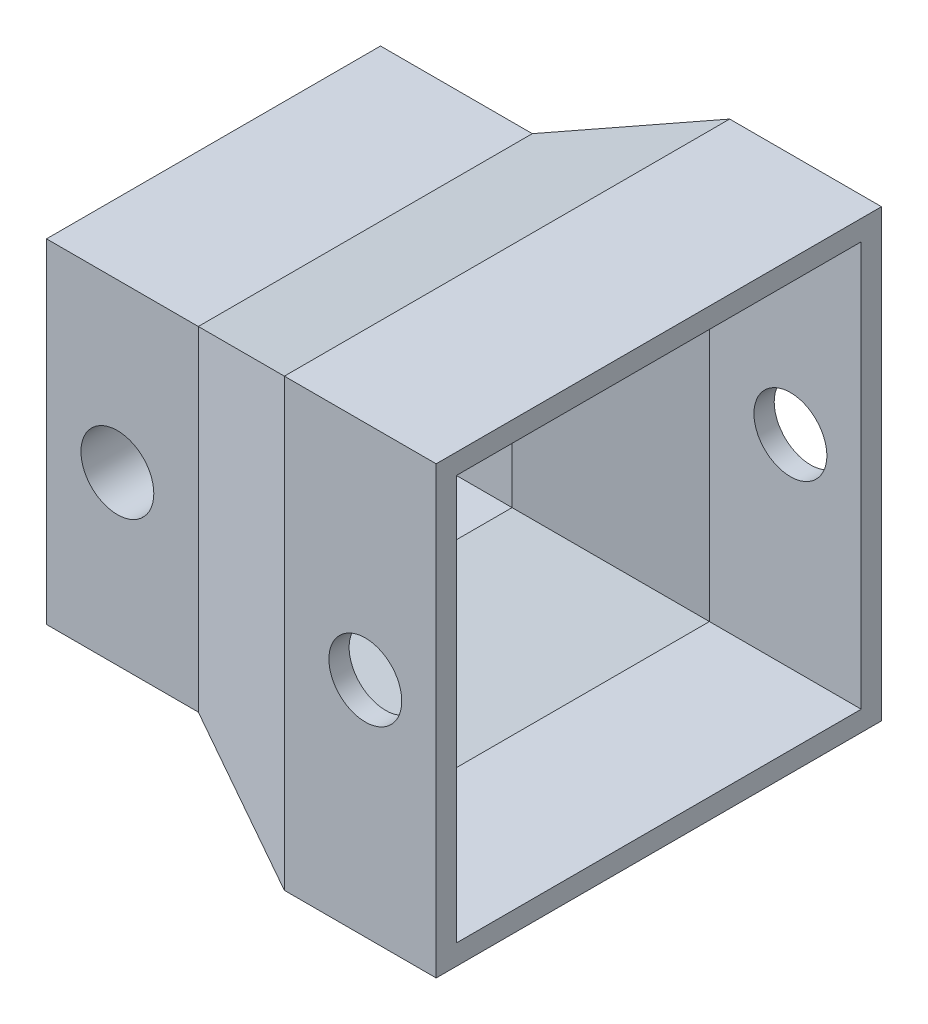
ISO-10303-21;
HEADER;
FILE_DESCRIPTION(('STEP AP214'),'2;1');
FILE_NAME('part.step','',(''),(''),'','','');
FILE_SCHEMA(('AUTOMOTIVE_DESIGN { 1 0 10303 214 1 1 1 1 }'));
ENDSEC;
DATA;
#1=APPLICATION_CONTEXT('core data for automotive mechanical design processes');
#2=APPLICATION_PROTOCOL_DEFINITION('international standard','automotive_design',2000,#1);
#3=PRODUCT_CONTEXT('',#1,'mechanical');
#4=PRODUCT('Part','Part','',(#3));
#5=PRODUCT_RELATED_PRODUCT_CATEGORY('part','',(#4));
#6=PRODUCT_DEFINITION_FORMATION('','',#4);
#7=PRODUCT_DEFINITION_CONTEXT('part definition',#1,'design');
#8=PRODUCT_DEFINITION('design','',#6,#7);
#9=PRODUCT_DEFINITION_SHAPE('','',#8);
#10=(LENGTH_UNIT() NAMED_UNIT(*) SI_UNIT(.MILLI.,.METRE.));
#11=(NAMED_UNIT(*) PLANE_ANGLE_UNIT() SI_UNIT($,.RADIAN.));
#12=(NAMED_UNIT(*) SI_UNIT($,.STERADIAN.) SOLID_ANGLE_UNIT());
#13=UNCERTAINTY_MEASURE_WITH_UNIT(LENGTH_MEASURE(1.E-05),#10,'distance_accuracy_value','');
#14=(GEOMETRIC_REPRESENTATION_CONTEXT(3) GLOBAL_UNCERTAINTY_ASSIGNED_CONTEXT((#13)) GLOBAL_UNIT_ASSIGNED_CONTEXT((#10,
#11,#12)) REPRESENTATION_CONTEXT('',''));
#15=CARTESIAN_POINT('',(0.,0.,0.));
#16=DIRECTION('',(0.,0.,1.));
#17=DIRECTION('',(1.,0.,0.));
#18=AXIS2_PLACEMENT_3D('',#15,#16,#17);
#19=CARTESIAN_POINT('',(11.,-11.,18.25));
#20=DIRECTION('',(0.,0.,1.));
#21=DIRECTION('',(1.,0.,0.));
#22=AXIS2_PLACEMENT_3D('',#19,#20,#21);
#23=PLANE('',#22);
#24=CARTESIAN_POINT('',(15.,0.,18.25));
#25=DIRECTION('',(0.,0.,1.));
#26=DIRECTION('',(1.,0.,0.));
#27=AXIS2_PLACEMENT_3D('',#24,#25,#26);
#28=CIRCLE('',#27,1.8);
#29=CARTESIAN_POINT('',(16.8,0.,18.25));
#30=VERTEX_POINT('',#29);
#31=EDGE_CURVE('E643',#30,#30,#28,.T.);
#32=ORIENTED_EDGE('',*,*,#31,.F.);
#33=EDGE_LOOP('',(#32));
#34=FACE_BOUND('',#33,.T.);
#35=DIRECTION('',(1.,0.,0.));
#36=VECTOR('',#35,1.);
#37=CARTESIAN_POINT('',(11.,-11.,18.25));
#38=LINE('',#37,#36);
#39=CARTESIAN_POINT('',(11.,-11.,18.25));
#40=VERTEX_POINT('',#39);
#41=CARTESIAN_POINT('',(18.5,-11.,18.25));
#42=VERTEX_POINT('',#41);
#43=EDGE_CURVE('E161',#40,#42,#38,.T.);
#44=ORIENTED_EDGE('',*,*,#43,.T.);
#45=DIRECTION('',(0.,-1.,0.));
#46=VECTOR('',#45,1.);
#47=CARTESIAN_POINT('',(18.5,-11.,18.25));
#48=LINE('',#47,#46);
#49=CARTESIAN_POINT('',(18.5,11.,18.25));
#50=VERTEX_POINT('',#49);
#51=EDGE_CURVE('E780',#50,#42,#48,.T.);
#52=ORIENTED_EDGE('',*,*,#51,.F.);
#53=DIRECTION('',(1.,0.,0.));
#54=VECTOR('',#53,1.);
#55=CARTESIAN_POINT('',(11.,11.,18.25));
#56=LINE('',#55,#54);
#57=CARTESIAN_POINT('',(11.,11.,18.25));
#58=VERTEX_POINT('',#57);
#59=EDGE_CURVE('E12',#58,#50,#56,.T.);
#60=ORIENTED_EDGE('',*,*,#59,.F.);
#61=CARTESIAN_POINT('',(11.,11.,18.25));
#62=DIRECTION('',(0.,-1.,0.));
#63=VECTOR('',#62,1.);
#64=LINE('',#61,#63);
#65=EDGE_CURVE('E177',#58,#40,#64,.T.);
#66=ORIENTED_EDGE('',*,*,#65,.T.);
#67=EDGE_LOOP('',(#44,#52,#60,#66));
#68=FACE_BOUND('',#67,.T.);
#69=ADVANCED_FACE('F76',(#34,#68),#23,.T.);
#70=CARTESIAN_POINT('',(11.,11.,18.25));
#71=DIRECTION('',(0.,1.,0.));
#72=DIRECTION('',(0.,0.,1.));
#73=AXIS2_PLACEMENT_3D('',#70,#71,#72);
#74=PLANE('',#73);
#75=ORIENTED_EDGE('',*,*,#59,.T.);
#76=DIRECTION('',(0.,0.,1.));
#77=VECTOR('',#76,1.);
#78=CARTESIAN_POINT('',(18.5,11.,18.25));
#79=LINE('',#78,#77);
#80=CARTESIAN_POINT('',(18.5,11.,-3.75));
#81=VERTEX_POINT('',#80);
#82=EDGE_CURVE('E771',#81,#50,#79,.T.);
#83=ORIENTED_EDGE('',*,*,#82,.F.);
#84=DIRECTION('',(1.,0.,0.));
#85=VECTOR('',#84,1.);
#86=CARTESIAN_POINT('',(11.,11.,-3.75));
#87=LINE('',#86,#85);
#88=CARTESIAN_POINT('',(11.,11.,-3.75));
#89=VERTEX_POINT('',#88);
#90=EDGE_CURVE('E87',#89,#81,#87,.T.);
#91=ORIENTED_EDGE('',*,*,#90,.F.);
#92=DIRECTION('',(0.,0.,1.));
#93=VECTOR('',#92,1.);
#94=CARTESIAN_POINT('',(11.,11.,18.25));
#95=LINE('',#94,#93);
#96=EDGE_CURVE('E96',#89,#58,#95,.T.);
#97=ORIENTED_EDGE('',*,*,#96,.T.);
#98=EDGE_LOOP('',(#75,#83,#91,#97));
#99=FACE_BOUND('',#98,.T.);
#100=ADVANCED_FACE('F541',(#99),#74,.T.);
#101=CARTESIAN_POINT('',(11.,-11.,-3.75));
#102=DIRECTION('',(0.,0.,-1.));
#103=DIRECTION('',(-1.,0.,0.));
#104=AXIS2_PLACEMENT_3D('',#101,#102,#103);
#105=PLANE('',#104);
#106=CARTESIAN_POINT('',(15.,0.,-3.75));
#107=DIRECTION('',(0.,0.,-1.));
#108=DIRECTION('',(-1.,0.,0.));
#109=AXIS2_PLACEMENT_3D('',#106,#107,#108);
#110=CIRCLE('',#109,1.8);
#111=CARTESIAN_POINT('',(13.2,0.,-3.75));
#112=VERTEX_POINT('',#111);
#113=EDGE_CURVE('E654',#112,#112,#110,.T.);
#114=ORIENTED_EDGE('',*,*,#113,.F.);
#115=EDGE_LOOP('',(#114));
#116=FACE_BOUND('',#115,.T.);
#117=ORIENTED_EDGE('',*,*,#90,.T.);
#118=DIRECTION('',(0.,1.,0.));
#119=VECTOR('',#118,1.);
#120=CARTESIAN_POINT('',(18.5,-11.,-3.75));
#121=LINE('',#120,#119);
#122=CARTESIAN_POINT('',(18.5,-11.,-3.75));
#123=VERTEX_POINT('',#122);
#124=EDGE_CURVE('E774',#123,#81,#121,.T.);
#125=ORIENTED_EDGE('',*,*,#124,.F.);
#126=DIRECTION('',(1.,0.,0.));
#127=VECTOR('',#126,1.);
#128=CARTESIAN_POINT('',(11.,-11.,-3.75));
#129=LINE('',#128,#127);
#130=CARTESIAN_POINT('',(11.,-11.,-3.75));
#131=VERTEX_POINT('',#130);
#132=EDGE_CURVE('E174',#131,#123,#129,.T.);
#133=ORIENTED_EDGE('',*,*,#132,.F.);
#134=CARTESIAN_POINT('',(11.,-11.,-3.75));
#135=DIRECTION('',(0.,1.,0.));
#136=VECTOR('',#135,1.);
#137=LINE('',#134,#136);
#138=EDGE_CURVE('E207',#131,#89,#137,.T.);
#139=ORIENTED_EDGE('',*,*,#138,.T.);
#140=EDGE_LOOP('',(#117,#125,#133,#139));
#141=FACE_BOUND('',#140,.T.);
#142=ADVANCED_FACE('F532',(#116,#141),#105,.T.);
#143=CARTESIAN_POINT('',(11.,-11.,18.25));
#144=DIRECTION('',(0.,-1.,0.));
#145=DIRECTION('',(0.,0.,-1.));
#146=AXIS2_PLACEMENT_3D('',#143,#144,#145);
#147=PLANE('',#146);
#148=ORIENTED_EDGE('',*,*,#132,.T.);
#149=DIRECTION('',(0.,0.,-1.));
#150=VECTOR('',#149,1.);
#151=CARTESIAN_POINT('',(18.5,-11.,18.25));
#152=LINE('',#151,#150);
#153=EDGE_CURVE('E169',#42,#123,#152,.T.);
#154=ORIENTED_EDGE('',*,*,#153,.F.);
#155=ORIENTED_EDGE('',*,*,#43,.F.);
#156=CARTESIAN_POINT('',(11.,-11.,18.25));
#157=DIRECTION('',(0.,0.,-1.));
#158=VECTOR('',#157,1.);
#159=LINE('',#156,#158);
#160=EDGE_CURVE('E165',#40,#131,#159,.T.);
#161=ORIENTED_EDGE('',*,*,#160,.T.);
#162=EDGE_LOOP('',(#148,#154,#155,#161));
#163=FACE_BOUND('',#162,.T.);
#164=ADVANCED_FACE('F163',(#163),#147,.T.);
#165=CARTESIAN_POINT('',(11.,-10.,17.25));
#166=DIRECTION('',(0.,0.,1.));
#167=DIRECTION('',(1.,0.,0.));
#168=AXIS2_PLACEMENT_3D('',#165,#166,#167);
#169=PLANE('',#168);
#170=CARTESIAN_POINT('',(15.,0.,17.25));
#171=DIRECTION('',(0.,0.,1.));
#172=DIRECTION('',(1.,0.,0.));
#173=AXIS2_PLACEMENT_3D('',#170,#171,#172);
#174=CIRCLE('',#173,1.8);
#175=CARTESIAN_POINT('',(16.8,0.,17.25));
#176=VERTEX_POINT('',#175);
#177=EDGE_CURVE('E649',#176,#176,#174,.T.);
#178=ORIENTED_EDGE('',*,*,#177,.T.);
#179=EDGE_LOOP('',(#178));
#180=FACE_BOUND('',#179,.T.);
#181=DIRECTION('',(1.,0.,0.));
#182=VECTOR('',#181,1.);
#183=CARTESIAN_POINT('',(11.,10.,17.25));
#184=LINE('',#183,#182);
#185=CARTESIAN_POINT('',(11.,10.,17.25));
#186=VERTEX_POINT('',#185);
#187=CARTESIAN_POINT('',(18.5,10.,17.25));
#188=VERTEX_POINT('',#187);
#189=EDGE_CURVE('E183',#186,#188,#184,.T.);
#190=ORIENTED_EDGE('',*,*,#189,.T.);
#191=DIRECTION('',(0.,-1.,0.));
#192=VECTOR('',#191,1.);
#193=CARTESIAN_POINT('',(18.5,-10.,17.25));
#194=LINE('',#193,#192);
#195=CARTESIAN_POINT('',(18.5,-10.,17.25));
#196=VERTEX_POINT('',#195);
#197=EDGE_CURVE('E795',#188,#196,#194,.T.);
#198=ORIENTED_EDGE('',*,*,#197,.T.);
#199=DIRECTION('',(1.,0.,0.));
#200=VECTOR('',#199,1.);
#201=CARTESIAN_POINT('',(11.,-10.,17.25));
#202=LINE('',#201,#200);
#203=CARTESIAN_POINT('',(11.,-10.,17.25));
#204=VERTEX_POINT('',#203);
#205=EDGE_CURVE('E595',#204,#196,#202,.T.);
#206=ORIENTED_EDGE('',*,*,#205,.F.);
#207=CARTESIAN_POINT('',(11.,9.99999999999996,17.25));
#208=DIRECTION('',(0.,-1.,0.));
#209=VECTOR('',#208,1.);
#210=LINE('',#207,#209);
#211=EDGE_CURVE('E769',#186,#204,#210,.T.);
#212=ORIENTED_EDGE('',*,*,#211,.F.);
#213=EDGE_LOOP('',(#190,#198,#206,#212));
#214=FACE_BOUND('',#213,.T.);
#215=ADVANCED_FACE('F546',(#180,#214),#169,.F.);
#216=CARTESIAN_POINT('',(11.,10.,-2.75));
#217=DIRECTION('',(0.,1.,0.));
#218=DIRECTION('',(0.,0.,1.));
#219=AXIS2_PLACEMENT_3D('',#216,#217,#218);
#220=PLANE('',#219);
#221=DIRECTION('',(1.,0.,0.));
#222=VECTOR('',#221,1.);
#223=CARTESIAN_POINT('',(11.,10.,-2.75));
#224=LINE('',#223,#222);
#225=CARTESIAN_POINT('',(11.,10.0000062500001,-2.75000624999989));
#226=VERTEX_POINT('',#225);
#227=CARTESIAN_POINT('',(18.5,10.,-2.75));
#228=VERTEX_POINT('',#227);
#229=EDGE_CURVE('E601',#226,#228,#224,.T.);
#230=ORIENTED_EDGE('',*,*,#229,.T.);
#231=DIRECTION('',(0.,0.,1.));
#232=VECTOR('',#231,1.);
#233=CARTESIAN_POINT('',(18.5,10.,-2.75));
#234=LINE('',#233,#232);
#235=EDGE_CURVE('E783',#228,#188,#234,.T.);
#236=ORIENTED_EDGE('',*,*,#235,.T.);
#237=ORIENTED_EDGE('',*,*,#189,.F.);
#238=DIRECTION('',(0.,0.,1.));
#239=VECTOR('',#238,1.);
#240=CARTESIAN_POINT('',(11.,10.,0.));
#241=LINE('',#240,#239);
#242=EDGE_CURVE('E117',#226,#186,#241,.T.);
#243=ORIENTED_EDGE('',*,*,#242,.F.);
#244=EDGE_LOOP('',(#230,#236,#237,#243));
#245=FACE_BOUND('',#244,.T.);
#246=ADVANCED_FACE('F580',(#245),#220,.F.);
#247=CARTESIAN_POINT('',(11.,-10.,-2.75));
#248=DIRECTION('',(0.,0.,-1.));
#249=DIRECTION('',(-1.,0.,0.));
#250=AXIS2_PLACEMENT_3D('',#247,#248,#249);
#251=PLANE('',#250);
#252=CARTESIAN_POINT('',(15.,0.,-2.75));
#253=DIRECTION('',(0.,0.,-1.));
#254=DIRECTION('',(-1.,0.,0.));
#255=AXIS2_PLACEMENT_3D('',#252,#253,#254);
#256=CIRCLE('',#255,1.8);
#257=CARTESIAN_POINT('',(13.2,0.,-2.75));
#258=VERTEX_POINT('',#257);
#259=EDGE_CURVE('E80',#258,#258,#256,.T.);
#260=ORIENTED_EDGE('',*,*,#259,.T.);
#261=EDGE_LOOP('',(#260));
#262=FACE_BOUND('',#261,.T.);
#263=DIRECTION('',(1.,0.,0.));
#264=VECTOR('',#263,1.);
#265=CARTESIAN_POINT('',(11.,-10.,-2.75));
#266=LINE('',#265,#264);
#267=CARTESIAN_POINT('',(11.,-9.99999999999989,-2.7500000000001));
#268=VERTEX_POINT('',#267);
#269=CARTESIAN_POINT('',(18.5,-10.,-2.75));
#270=VERTEX_POINT('',#269);
#271=EDGE_CURVE('E761',#268,#270,#266,.T.);
#272=ORIENTED_EDGE('',*,*,#271,.T.);
#273=DIRECTION('',(0.,1.,0.));
#274=VECTOR('',#273,1.);
#275=CARTESIAN_POINT('',(18.5,-10.,-2.75));
#276=LINE('',#275,#274);
#277=EDGE_CURVE('E787',#270,#228,#276,.T.);
#278=ORIENTED_EDGE('',*,*,#277,.T.);
#279=ORIENTED_EDGE('',*,*,#229,.F.);
#280=CARTESIAN_POINT('',(11.,-9.99999999999989,-2.7500000000001));
#281=DIRECTION('',(0.,1.,0.));
#282=VECTOR('',#281,1.);
#283=LINE('',#280,#282);
#284=EDGE_CURVE('E596',#268,#226,#283,.T.);
#285=ORIENTED_EDGE('',*,*,#284,.F.);
#286=EDGE_LOOP('',(#272,#278,#279,#285));
#287=FACE_BOUND('',#286,.T.);
#288=ADVANCED_FACE('F576',(#262,#287),#251,.F.);
#289=CARTESIAN_POINT('',(11.,-10.,-2.75));
#290=DIRECTION('',(0.,-1.,0.));
#291=DIRECTION('',(0.,0.,-1.));
#292=AXIS2_PLACEMENT_3D('',#289,#290,#291);
#293=PLANE('',#292);
#294=ORIENTED_EDGE('',*,*,#205,.T.);
#295=DIRECTION('',(0.,0.,-1.));
#296=VECTOR('',#295,1.);
#297=CARTESIAN_POINT('',(18.5,-10.,-2.75));
#298=LINE('',#297,#296);
#299=EDGE_CURVE('E791',#196,#270,#298,.T.);
#300=ORIENTED_EDGE('',*,*,#299,.T.);
#301=ORIENTED_EDGE('',*,*,#271,.F.);
#302=CARTESIAN_POINT('',(11.,-10.,17.25));
#303=DIRECTION('',(0.,0.,-1.));
#304=VECTOR('',#303,1.);
#305=LINE('',#302,#304);
#306=EDGE_CURVE('E561',#204,#268,#305,.T.);
#307=ORIENTED_EDGE('',*,*,#306,.F.);
#308=EDGE_LOOP('',(#294,#300,#301,#307));
#309=FACE_BOUND('',#308,.T.);
#310=ADVANCED_FACE('F567',(#309),#293,.F.);
#311=CARTESIAN_POINT('',(18.5,0.,0.));
#312=DIRECTION('',(-1.,0.,0.));
#313=DIRECTION('',(0.,0.,1.));
#314=AXIS2_PLACEMENT_3D('',#311,#312,#313);
#315=PLANE('',#314);
#316=ORIENTED_EDGE('',*,*,#51,.T.);
#317=ORIENTED_EDGE('',*,*,#153,.T.);
#318=ORIENTED_EDGE('',*,*,#124,.T.);
#319=ORIENTED_EDGE('',*,*,#82,.T.);
#320=EDGE_LOOP('',(#316,#317,#318,#319));
#321=FACE_BOUND('',#320,.T.);
#322=ORIENTED_EDGE('',*,*,#197,.F.);
#323=ORIENTED_EDGE('',*,*,#235,.F.);
#324=ORIENTED_EDGE('',*,*,#277,.F.);
#325=ORIENTED_EDGE('',*,*,#299,.F.);
#326=EDGE_LOOP('',(#322,#323,#324,#325));
#327=FACE_BOUND('',#326,.T.);
#328=ADVANCED_FACE('F452',(#321,#327),#315,.F.);
#329=CARTESIAN_POINT('',(-1.93259668508287,4.91933701657459,0.));
#330=DIRECTION('',(0.365652372422993,-0.930751493440347,0.));
#331=DIRECTION('',(0.930751493440347,0.365652372422993,0.));
#332=AXIS2_PLACEMENT_3D('',#329,#330,#331);
#333=PLANE('',#332);
#334=DIRECTION('',(-0.874146757476248,-0.343414797579954,-0.343414797579954));
#335=VECTOR('',#334,1.);
#336=CARTESIAN_POINT('',(11.,10.,17.25));
#337=LINE('',#336,#335);
#338=CARTESIAN_POINT('',(4.,7.25,14.5));
#339=VERTEX_POINT('',#338);
#340=EDGE_CURVE('E328',#186,#339,#337,.T.);
#341=ORIENTED_EDGE('',*,*,#340,.T.);
#342=DIRECTION('',(0.,0.,-1.));
#343=VECTOR('',#342,1.);
#344=CARTESIAN_POINT('',(4.,7.25,14.5));
#345=LINE('',#344,#343);
#346=CARTESIAN_POINT('',(4.,7.25000000000008,0.));
#347=VERTEX_POINT('',#346);
#348=EDGE_CURVE('E435',#339,#347,#345,.T.);
#349=ORIENTED_EDGE('',*,*,#348,.T.);
#350=DIRECTION('',(-0.874146757476248,-0.343414797579954,0.343414797579954));
#351=VECTOR('',#350,1.);
#352=CARTESIAN_POINT('',(11.,10.,-2.75));
#353=LINE('',#352,#351);
#354=EDGE_CURVE('E414',#226,#347,#353,.T.);
#355=ORIENTED_EDGE('',*,*,#354,.F.);
#356=ORIENTED_EDGE('',*,*,#242,.T.);
#357=EDGE_LOOP('',(#341,#349,#355,#356));
#358=FACE_BOUND('',#357,.T.);
#359=ADVANCED_FACE('F441',(#358),#333,.T.);
#360=CARTESIAN_POINT('',(-2.27292817679558,5.78563535911603,0.));
#361=DIRECTION('',(-0.365652372422993,0.930751493440347,0.));
#362=DIRECTION('',(-0.930751493440347,-0.365652372422993,0.));
#363=AXIS2_PLACEMENT_3D('',#360,#361,#362);
#364=PLANE('',#363);
#365=DIRECTION('',(-0.874146757476248,-0.343414797579954,0.343414797579954));
#366=VECTOR('',#365,1.);
#367=CARTESIAN_POINT('',(11.,11.,-3.75));
#368=LINE('',#367,#366);
#369=CARTESIAN_POINT('',(4.,8.25,-1.));
#370=VERTEX_POINT('',#369);
#371=EDGE_CURVE('E419',#89,#370,#368,.T.);
#372=ORIENTED_EDGE('',*,*,#371,.T.);
#373=DIRECTION('',(0.,0.,1.));
#374=VECTOR('',#373,1.);
#375=CARTESIAN_POINT('',(4.,8.25,-1.));
#376=LINE('',#375,#374);
#377=CARTESIAN_POINT('',(4.,8.25,15.5));
#378=VERTEX_POINT('',#377);
#379=EDGE_CURVE('E424',#370,#378,#376,.T.);
#380=ORIENTED_EDGE('',*,*,#379,.T.);
#381=DIRECTION('',(-0.874146757476248,-0.343414797579954,-0.343414797579954));
#382=VECTOR('',#381,1.);
#383=CARTESIAN_POINT('',(11.,11.,18.25));
#384=LINE('',#383,#382);
#385=EDGE_CURVE('E106',#58,#378,#384,.T.);
#386=ORIENTED_EDGE('',*,*,#385,.F.);
#387=ORIENTED_EDGE('',*,*,#96,.F.);
#388=EDGE_LOOP('',(#372,#380,#386,#387));
#389=FACE_BOUND('',#388,.T.);
#390=ADVANCED_FACE('F451',(#389),#364,.T.);
#391=CARTESIAN_POINT('',(0.,0.,1.5));
#392=DIRECTION('',(0.,0.,-1.));
#393=DIRECTION('',(-1.,0.,0.));
#394=AXIS2_PLACEMENT_3D('',#391,#392,#393);
#395=CYLINDRICAL_SURFACE('',#394,2.5);
#396=CARTESIAN_POINT('',(0.,0.,1.5));
#397=DIRECTION('',(0.,0.,1.));
#398=DIRECTION('',(1.,0.,0.));
#399=AXIS2_PLACEMENT_3D('',#396,#397,#398);
#400=CIRCLE('',#399,2.5);
#401=CARTESIAN_POINT('',(2.5,0.,1.5));
#402=VERTEX_POINT('',#401);
#403=EDGE_CURVE('E377',#402,#402,#400,.T.);
#404=ORIENTED_EDGE('',*,*,#403,.F.);
#405=EDGE_LOOP('',(#404));
#406=FACE_BOUND('',#405,.T.);
#407=CARTESIAN_POINT('',(0.,0.,0.));
#408=DIRECTION('',(0.,0.,-1.));
#409=DIRECTION('',(-1.,0.,0.));
#410=AXIS2_PLACEMENT_3D('',#407,#408,#409);
#411=CIRCLE('',#410,2.5);
#412=CARTESIAN_POINT('',(-2.5,0.,0.));
#413=VERTEX_POINT('',#412);
#414=EDGE_CURVE('E314',#413,#413,#411,.T.);
#415=ORIENTED_EDGE('',*,*,#414,.F.);
#416=EDGE_LOOP('',(#415));
#417=FACE_BOUND('',#416,.T.);
#418=ADVANCED_FACE('F453',(#406,#417),#395,.T.);
#419=CARTESIAN_POINT('',(0.,0.,2.5));
#420=DIRECTION('',(0.,0.,-1.));
#421=DIRECTION('',(-1.,0.,0.));
#422=AXIS2_PLACEMENT_3D('',#419,#420,#421);
#423=CYLINDRICAL_SURFACE('',#422,3.5);
#424=CARTESIAN_POINT('',(0.,0.,2.5));
#425=DIRECTION('',(0.,0.,1.));
#426=DIRECTION('',(1.,0.,0.));
#427=AXIS2_PLACEMENT_3D('',#424,#425,#426);
#428=CIRCLE('',#427,3.5);
#429=CARTESIAN_POINT('',(3.5,0.,2.5));
#430=VERTEX_POINT('',#429);
#431=EDGE_CURVE('E378',#430,#430,#428,.T.);
#432=ORIENTED_EDGE('',*,*,#431,.F.);
#433=EDGE_LOOP('',(#432));
#434=FACE_BOUND('',#433,.T.);
#435=CARTESIAN_POINT('',(0.,0.,1.5));
#436=DIRECTION('',(0.,0.,1.));
#437=DIRECTION('',(1.,0.,0.));
#438=AXIS2_PLACEMENT_3D('',#435,#436,#437);
#439=CIRCLE('',#438,3.5);
#440=CARTESIAN_POINT('',(3.5,0.,1.5));
#441=VERTEX_POINT('',#440);
#442=EDGE_CURVE('E373',#441,#441,#439,.T.);
#443=ORIENTED_EDGE('',*,*,#442,.T.);
#444=EDGE_LOOP('',(#443));
#445=FACE_BOUND('',#444,.T.);
#446=ADVANCED_FACE('F1056',(#434,#445),#423,.T.);
#447=CARTESIAN_POINT('',(0.,0.,2.5));
#448=DIRECTION('',(0.,0.,1.));
#449=DIRECTION('',(1.,0.,0.));
#450=AXIS2_PLACEMENT_3D('',#447,#448,#449);
#451=PLANE('',#450);
#452=CARTESIAN_POINT('',(0.,0.,2.5));
#453=DIRECTION('',(0.,0.,1.));
#454=DIRECTION('',(1.,0.,0.));
#455=AXIS2_PLACEMENT_3D('',#452,#453,#454);
#456=CIRCLE('',#455,2.5);
#457=CARTESIAN_POINT('',(2.5,0.,2.5));
#458=VERTEX_POINT('',#457);
#459=EDGE_CURVE('E361',#458,#458,#456,.T.);
#460=ORIENTED_EDGE('',*,*,#459,.F.);
#461=EDGE_LOOP('',(#460));
#462=FACE_BOUND('',#461,.T.);
#463=ORIENTED_EDGE('',*,*,#431,.T.);
#464=EDGE_LOOP('',(#463));
#465=FACE_BOUND('',#464,.T.);
#466=ADVANCED_FACE('F1046',(#462,#465),#451,.T.);
#467=CARTESIAN_POINT('',(0.,0.,1.5));
#468=DIRECTION('',(0.,0.,1.));
#469=DIRECTION('',(1.,0.,0.));
#470=AXIS2_PLACEMENT_3D('',#467,#468,#469);
#471=PLANE('',#470);
#472=ORIENTED_EDGE('',*,*,#403,.T.);
#473=EDGE_LOOP('',(#472));
#474=FACE_BOUND('',#473,.T.);
#475=ORIENTED_EDGE('',*,*,#442,.F.);
#476=EDGE_LOOP('',(#475));
#477=FACE_BOUND('',#476,.T.);
#478=ADVANCED_FACE('F1036',(#474,#477),#471,.F.);
#479=CARTESIAN_POINT('',(0.,0.,5.));
#480=DIRECTION('',(0.,0.,-1.));
#481=DIRECTION('',(-1.,0.,0.));
#482=AXIS2_PLACEMENT_3D('',#479,#480,#481);
#483=CYLINDRICAL_SURFACE('',#482,2.5);
#484=CARTESIAN_POINT('',(0.,0.,5.));
#485=DIRECTION('',(0.,0.,1.));
#486=DIRECTION('',(1.,0.,0.));
#487=AXIS2_PLACEMENT_3D('',#484,#485,#486);
#488=CIRCLE('',#487,2.5);
#489=CARTESIAN_POINT('',(2.5,0.,5.));
#490=VERTEX_POINT('',#489);
#491=EDGE_CURVE('E366',#490,#490,#488,.T.);
#492=ORIENTED_EDGE('',*,*,#491,.F.);
#493=EDGE_LOOP('',(#492));
#494=FACE_BOUND('',#493,.T.);
#495=ORIENTED_EDGE('',*,*,#459,.T.);
#496=EDGE_LOOP('',(#495));
#497=FACE_BOUND('',#496,.T.);
#498=ADVANCED_FACE('F1026',(#494,#497),#483,.T.);
#499=CARTESIAN_POINT('',(0.,0.,6.));
#500=DIRECTION('',(0.,0.,-1.));
#501=DIRECTION('',(-1.,0.,0.));
#502=AXIS2_PLACEMENT_3D('',#499,#500,#501);
#503=CYLINDRICAL_SURFACE('',#502,3.5);
#504=CARTESIAN_POINT('',(0.,0.,6.));
#505=DIRECTION('',(0.,0.,1.));
#506=DIRECTION('',(1.,0.,0.));
#507=AXIS2_PLACEMENT_3D('',#504,#505,#506);
#508=CIRCLE('',#507,3.5);
#509=CARTESIAN_POINT('',(3.5,0.,6.));
#510=VERTEX_POINT('',#509);
#511=EDGE_CURVE('E362',#510,#510,#508,.T.);
#512=ORIENTED_EDGE('',*,*,#511,.F.);
#513=EDGE_LOOP('',(#512));
#514=FACE_BOUND('',#513,.T.);
#515=CARTESIAN_POINT('',(0.,0.,5.));
#516=DIRECTION('',(0.,0.,1.));
#517=DIRECTION('',(1.,0.,0.));
#518=AXIS2_PLACEMENT_3D('',#515,#516,#517);
#519=CIRCLE('',#518,3.5);
#520=CARTESIAN_POINT('',(3.5,0.,5.));
#521=VERTEX_POINT('',#520);
#522=EDGE_CURVE('E357',#521,#521,#519,.T.);
#523=ORIENTED_EDGE('',*,*,#522,.T.);
#524=EDGE_LOOP('',(#523));
#525=FACE_BOUND('',#524,.T.);
#526=ADVANCED_FACE('F1016',(#514,#525),#503,.T.);
#527=CARTESIAN_POINT('',(0.,0.,6.));
#528=DIRECTION('',(0.,0.,1.));
#529=DIRECTION('',(1.,0.,0.));
#530=AXIS2_PLACEMENT_3D('',#527,#528,#529);
#531=PLANE('',#530);
#532=CARTESIAN_POINT('',(0.,0.,6.));
#533=DIRECTION('',(0.,0.,1.));
#534=DIRECTION('',(1.,0.,0.));
#535=AXIS2_PLACEMENT_3D('',#532,#533,#534);
#536=CIRCLE('',#535,2.5);
#537=CARTESIAN_POINT('',(2.5,0.,6.));
#538=VERTEX_POINT('',#537);
#539=EDGE_CURVE('E345',#538,#538,#536,.T.);
#540=ORIENTED_EDGE('',*,*,#539,.F.);
#541=EDGE_LOOP('',(#540));
#542=FACE_BOUND('',#541,.T.);
#543=ORIENTED_EDGE('',*,*,#511,.T.);
#544=EDGE_LOOP('',(#543));
#545=FACE_BOUND('',#544,.T.);
#546=ADVANCED_FACE('F1006',(#542,#545),#531,.T.);
#547=CARTESIAN_POINT('',(0.,0.,5.));
#548=DIRECTION('',(0.,0.,1.));
#549=DIRECTION('',(1.,0.,0.));
#550=AXIS2_PLACEMENT_3D('',#547,#548,#549);
#551=PLANE('',#550);
#552=ORIENTED_EDGE('',*,*,#491,.T.);
#553=EDGE_LOOP('',(#552));
#554=FACE_BOUND('',#553,.T.);
#555=ORIENTED_EDGE('',*,*,#522,.F.);
#556=EDGE_LOOP('',(#555));
#557=FACE_BOUND('',#556,.T.);
#558=ADVANCED_FACE('F996',(#554,#557),#551,.F.);
#559=CARTESIAN_POINT('',(0.,0.,8.5));
#560=DIRECTION('',(0.,0.,-1.));
#561=DIRECTION('',(-1.,0.,0.));
#562=AXIS2_PLACEMENT_3D('',#559,#560,#561);
#563=CYLINDRICAL_SURFACE('',#562,2.5);
#564=CARTESIAN_POINT('',(0.,0.,8.5));
#565=DIRECTION('',(0.,0.,1.));
#566=DIRECTION('',(1.,0.,0.));
#567=AXIS2_PLACEMENT_3D('',#564,#565,#566);
#568=CIRCLE('',#567,2.5);
#569=CARTESIAN_POINT('',(2.5,0.,8.5));
#570=VERTEX_POINT('',#569);
#571=EDGE_CURVE('E350',#570,#570,#568,.T.);
#572=ORIENTED_EDGE('',*,*,#571,.F.);
#573=EDGE_LOOP('',(#572));
#574=FACE_BOUND('',#573,.T.);
#575=ORIENTED_EDGE('',*,*,#539,.T.);
#576=EDGE_LOOP('',(#575));
#577=FACE_BOUND('',#576,.T.);
#578=ADVANCED_FACE('F986',(#574,#577),#563,.T.);
#579=CARTESIAN_POINT('',(0.,0.,9.5));
#580=DIRECTION('',(0.,0.,-1.));
#581=DIRECTION('',(-1.,0.,0.));
#582=AXIS2_PLACEMENT_3D('',#579,#580,#581);
#583=CYLINDRICAL_SURFACE('',#582,3.5);
#584=CARTESIAN_POINT('',(0.,0.,9.5));
#585=DIRECTION('',(0.,0.,1.));
#586=DIRECTION('',(1.,0.,0.));
#587=AXIS2_PLACEMENT_3D('',#584,#585,#586);
#588=CIRCLE('',#587,3.5);
#589=CARTESIAN_POINT('',(3.5,0.,9.5));
#590=VERTEX_POINT('',#589);
#591=EDGE_CURVE('E346',#590,#590,#588,.T.);
#592=ORIENTED_EDGE('',*,*,#591,.F.);
#593=EDGE_LOOP('',(#592));
#594=FACE_BOUND('',#593,.T.);
#595=CARTESIAN_POINT('',(0.,0.,8.5));
#596=DIRECTION('',(0.,0.,1.));
#597=DIRECTION('',(1.,0.,0.));
#598=AXIS2_PLACEMENT_3D('',#595,#596,#597);
#599=CIRCLE('',#598,3.5);
#600=CARTESIAN_POINT('',(3.5,0.,8.5));
#601=VERTEX_POINT('',#600);
#602=EDGE_CURVE('E341',#601,#601,#599,.T.);
#603=ORIENTED_EDGE('',*,*,#602,.T.);
#604=EDGE_LOOP('',(#603));
#605=FACE_BOUND('',#604,.T.);
#606=ADVANCED_FACE('F976',(#594,#605),#583,.T.);
#607=CARTESIAN_POINT('',(0.,0.,9.5));
#608=DIRECTION('',(0.,0.,1.));
#609=DIRECTION('',(1.,0.,0.));
#610=AXIS2_PLACEMENT_3D('',#607,#608,#609);
#611=PLANE('',#610);
#612=CARTESIAN_POINT('',(0.,0.,9.5));
#613=DIRECTION('',(0.,0.,1.));
#614=DIRECTION('',(1.,0.,0.));
#615=AXIS2_PLACEMENT_3D('',#612,#613,#614);
#616=CIRCLE('',#615,2.5);
#617=CARTESIAN_POINT('',(2.5,0.,9.5));
#618=VERTEX_POINT('',#617);
#619=EDGE_CURVE('E329',#618,#618,#616,.T.);
#620=ORIENTED_EDGE('',*,*,#619,.F.);
#621=EDGE_LOOP('',(#620));
#622=FACE_BOUND('',#621,.T.);
#623=ORIENTED_EDGE('',*,*,#591,.T.);
#624=EDGE_LOOP('',(#623));
#625=FACE_BOUND('',#624,.T.);
#626=ADVANCED_FACE('F966',(#622,#625),#611,.T.);
#627=CARTESIAN_POINT('',(0.,0.,8.5));
#628=DIRECTION('',(0.,0.,1.));
#629=DIRECTION('',(1.,0.,0.));
#630=AXIS2_PLACEMENT_3D('',#627,#628,#629);
#631=PLANE('',#630);
#632=ORIENTED_EDGE('',*,*,#571,.T.);
#633=EDGE_LOOP('',(#632));
#634=FACE_BOUND('',#633,.T.);
#635=ORIENTED_EDGE('',*,*,#602,.F.);
#636=EDGE_LOOP('',(#635));
#637=FACE_BOUND('',#636,.T.);
#638=ADVANCED_FACE('F956',(#634,#637),#631,.F.);
#639=CARTESIAN_POINT('',(0.,0.,12.));
#640=DIRECTION('',(0.,0.,-1.));
#641=DIRECTION('',(-1.,0.,0.));
#642=AXIS2_PLACEMENT_3D('',#639,#640,#641);
#643=CYLINDRICAL_SURFACE('',#642,2.5);
#644=CARTESIAN_POINT('',(0.,0.,12.));
#645=DIRECTION('',(0.,0.,1.));
#646=DIRECTION('',(1.,0.,0.));
#647=AXIS2_PLACEMENT_3D('',#644,#645,#646);
#648=CIRCLE('',#647,2.5);
#649=CARTESIAN_POINT('',(2.5,0.,12.));
#650=VERTEX_POINT('',#649);
#651=EDGE_CURVE('E334',#650,#650,#648,.T.);
#652=ORIENTED_EDGE('',*,*,#651,.F.);
#653=EDGE_LOOP('',(#652));
#654=FACE_BOUND('',#653,.T.);
#655=ORIENTED_EDGE('',*,*,#619,.T.);
#656=EDGE_LOOP('',(#655));
#657=FACE_BOUND('',#656,.T.);
#658=ADVANCED_FACE('F946',(#654,#657),#643,.T.);
#659=CARTESIAN_POINT('',(0.,0.,13.));
#660=DIRECTION('',(0.,0.,-1.));
#661=DIRECTION('',(-1.,0.,0.));
#662=AXIS2_PLACEMENT_3D('',#659,#660,#661);
#663=CYLINDRICAL_SURFACE('',#662,3.5);
#664=CARTESIAN_POINT('',(0.,0.,13.));
#665=DIRECTION('',(0.,0.,1.));
#666=DIRECTION('',(1.,0.,0.));
#667=AXIS2_PLACEMENT_3D('',#664,#665,#666);
#668=CIRCLE('',#667,3.5);
#669=CARTESIAN_POINT('',(3.5,0.,13.));
#670=VERTEX_POINT('',#669);
#671=EDGE_CURVE('E330',#670,#670,#668,.T.);
#672=ORIENTED_EDGE('',*,*,#671,.F.);
#673=EDGE_LOOP('',(#672));
#674=FACE_BOUND('',#673,.T.);
#675=CARTESIAN_POINT('',(0.,0.,12.));
#676=DIRECTION('',(0.,0.,1.));
#677=DIRECTION('',(1.,0.,0.));
#678=AXIS2_PLACEMENT_3D('',#675,#676,#677);
#679=CIRCLE('',#678,3.5);
#680=CARTESIAN_POINT('',(3.5,0.,12.));
#681=VERTEX_POINT('',#680);
#682=EDGE_CURVE('E323',#681,#681,#679,.T.);
#683=ORIENTED_EDGE('',*,*,#682,.T.);
#684=EDGE_LOOP('',(#683));
#685=FACE_BOUND('',#684,.T.);
#686=ADVANCED_FACE('F936',(#674,#685),#663,.T.);
#687=CARTESIAN_POINT('',(0.,0.,13.));
#688=DIRECTION('',(0.,0.,1.));
#689=DIRECTION('',(1.,0.,0.));
#690=AXIS2_PLACEMENT_3D('',#687,#688,#689);
#691=PLANE('',#690);
#692=CARTESIAN_POINT('',(0.,0.,13.));
#693=DIRECTION('',(0.,0.,1.));
#694=DIRECTION('',(1.,0.,0.));
#695=AXIS2_PLACEMENT_3D('',#692,#693,#694);
#696=CIRCLE('',#695,2.5);
#697=CARTESIAN_POINT('',(2.5,0.,13.));
#698=VERTEX_POINT('',#697);
#699=EDGE_CURVE('E324',#698,#698,#696,.T.);
#700=ORIENTED_EDGE('',*,*,#699,.F.);
#701=EDGE_LOOP('',(#700));
#702=FACE_BOUND('',#701,.T.);
#703=ORIENTED_EDGE('',*,*,#671,.T.);
#704=EDGE_LOOP('',(#703));
#705=FACE_BOUND('',#704,.T.);
#706=ADVANCED_FACE('F926',(#702,#705),#691,.T.);
#707=CARTESIAN_POINT('',(0.,0.,12.));
#708=DIRECTION('',(0.,0.,1.));
#709=DIRECTION('',(1.,0.,0.));
#710=AXIS2_PLACEMENT_3D('',#707,#708,#709);
#711=PLANE('',#710);
#712=ORIENTED_EDGE('',*,*,#651,.T.);
#713=EDGE_LOOP('',(#712));
#714=FACE_BOUND('',#713,.T.);
#715=ORIENTED_EDGE('',*,*,#682,.F.);
#716=EDGE_LOOP('',(#715));
#717=FACE_BOUND('',#716,.T.);
#718=ADVANCED_FACE('F916',(#714,#717),#711,.F.);
#719=CARTESIAN_POINT('',(0.,0.,14.5));
#720=DIRECTION('',(0.,0.,-1.));
#721=DIRECTION('',(-1.,0.,0.));
#722=AXIS2_PLACEMENT_3D('',#719,#720,#721);
#723=CYLINDRICAL_SURFACE('',#722,2.5);
#724=CARTESIAN_POINT('',(0.,0.,14.5));
#725=DIRECTION('',(0.,0.,1.));
#726=DIRECTION('',(1.,0.,0.));
#727=AXIS2_PLACEMENT_3D('',#724,#725,#726);
#728=CIRCLE('',#727,2.5);
#729=CARTESIAN_POINT('',(2.5,0.,14.5));
#730=VERTEX_POINT('',#729);
#731=EDGE_CURVE('E318',#730,#730,#728,.T.);
#732=ORIENTED_EDGE('',*,*,#731,.F.);
#733=EDGE_LOOP('',(#732));
#734=FACE_BOUND('',#733,.T.);
#735=ORIENTED_EDGE('',*,*,#699,.T.);
#736=EDGE_LOOP('',(#735));
#737=FACE_BOUND('',#736,.T.);
#738=ADVANCED_FACE('F625',(#734,#737),#723,.T.);
#739=CARTESIAN_POINT('',(-3.5,-7.25,14.5));
#740=DIRECTION('',(0.,0.,1.));
#741=DIRECTION('',(1.,0.,0.));
#742=AXIS2_PLACEMENT_3D('',#739,#740,#741);
#743=PLANE('',#742);
#744=DIRECTION('',(1.,0.,0.));
#745=VECTOR('',#744,1.);
#746=CARTESIAN_POINT('',(-3.5,7.25,14.5));
#747=LINE('',#746,#745);
#748=CARTESIAN_POINT('',(-3.5,7.25,14.5));
#749=VERTEX_POINT('',#748);
#750=EDGE_CURVE('E301',#749,#339,#747,.T.);
#751=ORIENTED_EDGE('',*,*,#750,.T.);
#752=CARTESIAN_POINT('',(4.,7.25,14.5));
#753=DIRECTION('',(0.,-1.,0.));
#754=VECTOR('',#753,1.);
#755=LINE('',#752,#754);
#756=CARTESIAN_POINT('',(4.,-7.25,14.5));
#757=VERTEX_POINT('',#756);
#758=EDGE_CURVE('E198',#339,#757,#755,.T.);
#759=ORIENTED_EDGE('',*,*,#758,.T.);
#760=DIRECTION('',(1.,0.,0.));
#761=VECTOR('',#760,1.);
#762=CARTESIAN_POINT('',(-3.5,-7.25,14.5));
#763=LINE('',#762,#761);
#764=CARTESIAN_POINT('',(-3.5,-7.25,14.5));
#765=VERTEX_POINT('',#764);
#766=EDGE_CURVE('E295',#765,#757,#763,.T.);
#767=ORIENTED_EDGE('',*,*,#766,.F.);
#768=DIRECTION('',(0.,-1.,0.));
#769=VECTOR('',#768,1.);
#770=CARTESIAN_POINT('',(-3.5,-7.25,14.5));
#771=LINE('',#770,#769);
#772=EDGE_CURVE('E275',#749,#765,#771,.T.);
#773=ORIENTED_EDGE('',*,*,#772,.F.);
#774=EDGE_LOOP('',(#751,#759,#767,#773));
#775=FACE_BOUND('',#774,.T.);
#776=ORIENTED_EDGE('',*,*,#731,.T.);
#777=EDGE_LOOP('',(#776));
#778=FACE_BOUND('',#777,.T.);
#779=ADVANCED_FACE('F615',(#775,#778),#743,.F.);
#780=CARTESIAN_POINT('',(-3.5,-7.25,0.));
#781=DIRECTION('',(0.,0.,-1.));
#782=DIRECTION('',(-1.,0.,0.));
#783=AXIS2_PLACEMENT_3D('',#780,#781,#782);
#784=PLANE('',#783);
#785=DIRECTION('',(1.,0.,0.));
#786=VECTOR('',#785,1.);
#787=CARTESIAN_POINT('',(-3.5,-7.25,0.));
#788=LINE('',#787,#786);
#789=CARTESIAN_POINT('',(-3.5,-7.25,0.));
#790=VERTEX_POINT('',#789);
#791=CARTESIAN_POINT('',(4.,-7.25,0.));
#792=VERTEX_POINT('',#791);
#793=EDGE_CURVE('E409',#790,#792,#788,.T.);
#794=ORIENTED_EDGE('',*,*,#793,.T.);
#795=CARTESIAN_POINT('',(4.,-7.25,0.));
#796=DIRECTION('',(0.,1.,0.));
#797=VECTOR('',#796,1.);
#798=LINE('',#795,#797);
#799=EDGE_CURVE('E742',#792,#347,#798,.T.);
#800=ORIENTED_EDGE('',*,*,#799,.T.);
#801=DIRECTION('',(1.,0.,0.));
#802=VECTOR('',#801,1.);
#803=CARTESIAN_POINT('',(-3.5,7.25,0.));
#804=LINE('',#803,#802);
#805=CARTESIAN_POINT('',(-3.5,7.25,0.));
#806=VERTEX_POINT('',#805);
#807=EDGE_CURVE('E391',#806,#347,#804,.T.);
#808=ORIENTED_EDGE('',*,*,#807,.F.);
#809=DIRECTION('',(0.,1.,0.));
#810=VECTOR('',#809,1.);
#811=CARTESIAN_POINT('',(-3.5,-7.25,0.));
#812=LINE('',#811,#810);
#813=EDGE_CURVE('E126',#790,#806,#812,.T.);
#814=ORIENTED_EDGE('',*,*,#813,.F.);
#815=EDGE_LOOP('',(#794,#800,#808,#814));
#816=FACE_BOUND('',#815,.T.);
#817=ORIENTED_EDGE('',*,*,#414,.T.);
#818=EDGE_LOOP('',(#817));
#819=FACE_BOUND('',#818,.T.);
#820=ADVANCED_FACE('F624',(#816,#819),#784,.F.);
#821=CARTESIAN_POINT('',(-3.5,-8.25,15.5));
#822=DIRECTION('',(0.,0.,1.));
#823=DIRECTION('',(1.,0.,0.));
#824=AXIS2_PLACEMENT_3D('',#821,#822,#823);
#825=PLANE('',#824);
#826=CARTESIAN_POINT('',(0.,0.,15.5));
#827=DIRECTION('',(0.,0.,1.));
#828=DIRECTION('',(1.,0.,0.));
#829=AXIS2_PLACEMENT_3D('',#826,#827,#828);
#830=CIRCLE('',#829,1.8);
#831=CARTESIAN_POINT('',(1.8,0.,15.5));
#832=VERTEX_POINT('',#831);
#833=EDGE_CURVE('E658',#832,#832,#830,.T.);
#834=ORIENTED_EDGE('',*,*,#833,.F.);
#835=EDGE_LOOP('',(#834));
#836=FACE_BOUND('',#835,.T.);
#837=DIRECTION('',(1.,0.,0.));
#838=VECTOR('',#837,1.);
#839=CARTESIAN_POINT('',(-3.5,-8.25,15.5));
#840=LINE('',#839,#838);
#841=CARTESIAN_POINT('',(-3.5,-8.25,15.5));
#842=VERTEX_POINT('',#841);
#843=CARTESIAN_POINT('',(4.,-8.25,15.5));
#844=VERTEX_POINT('',#843);
#845=EDGE_CURVE('E313',#842,#844,#840,.T.);
#846=ORIENTED_EDGE('',*,*,#845,.T.);
#847=CARTESIAN_POINT('',(4.,8.24999999999997,15.5));
#848=DIRECTION('',(0.,-1.,0.));
#849=VECTOR('',#848,1.);
#850=LINE('',#847,#849);
#851=EDGE_CURVE('E192',#378,#844,#850,.T.);
#852=ORIENTED_EDGE('',*,*,#851,.F.);
#853=DIRECTION('',(1.,0.,0.));
#854=VECTOR('',#853,1.);
#855=CARTESIAN_POINT('',(-3.5,8.25,15.5));
#856=LINE('',#855,#854);
#857=CARTESIAN_POINT('',(-3.5,8.25,15.5));
#858=VERTEX_POINT('',#857);
#859=EDGE_CURVE('E319',#858,#378,#856,.T.);
#860=ORIENTED_EDGE('',*,*,#859,.F.);
#861=DIRECTION('',(0.,-1.,0.));
#862=VECTOR('',#861,1.);
#863=CARTESIAN_POINT('',(-3.5,-8.25,15.5));
#864=LINE('',#863,#862);
#865=EDGE_CURVE('E296',#858,#842,#864,.T.);
#866=ORIENTED_EDGE('',*,*,#865,.T.);
#867=EDGE_LOOP('',(#846,#852,#860,#866));
#868=FACE_BOUND('',#867,.T.);
#869=ADVANCED_FACE('F510',(#836,#868),#825,.T.);
#870=CARTESIAN_POINT('',(-3.5,8.25,-1.));
#871=DIRECTION('',(0.,1.,0.));
#872=DIRECTION('',(0.,0.,1.));
#873=AXIS2_PLACEMENT_3D('',#870,#871,#872);
#874=PLANE('',#873);
#875=ORIENTED_EDGE('',*,*,#859,.T.);
#876=ORIENTED_EDGE('',*,*,#379,.F.);
#877=DIRECTION('',(1.,0.,0.));
#878=VECTOR('',#877,1.);
#879=CARTESIAN_POINT('',(-3.5,8.25,-1.));
#880=LINE('',#879,#878);
#881=CARTESIAN_POINT('',(-3.5,8.25,-1.));
#882=VERTEX_POINT('',#881);
#883=EDGE_CURVE('E397',#882,#370,#880,.T.);
#884=ORIENTED_EDGE('',*,*,#883,.F.);
#885=DIRECTION('',(0.,0.,1.));
#886=VECTOR('',#885,1.);
#887=CARTESIAN_POINT('',(-3.5,8.25,-1.));
#888=LINE('',#887,#886);
#889=EDGE_CURVE('E309',#882,#858,#888,.T.);
#890=ORIENTED_EDGE('',*,*,#889,.T.);
#891=EDGE_LOOP('',(#875,#876,#884,#890));
#892=FACE_BOUND('',#891,.T.);
#893=ADVANCED_FACE('F501',(#892),#874,.T.);
#894=CARTESIAN_POINT('',(-3.5,-8.25,-1.));
#895=DIRECTION('',(0.,0.,-1.));
#896=DIRECTION('',(0.,1.,0.));
#897=AXIS2_PLACEMENT_3D('',#894,#895,#896);
#898=PLANE('',#897);
#899=CARTESIAN_POINT('',(0.,0.,-1.));
#900=DIRECTION('',(0.,0.,-1.));
#901=DIRECTION('',(0.,1.,0.));
#902=AXIS2_PLACEMENT_3D('',#899,#900,#901);
#903=CIRCLE('',#902,1.8);
#904=CARTESIAN_POINT('',(0.,1.8,-1.));
#905=VERTEX_POINT('',#904);
#906=EDGE_CURVE('E662',#905,#905,#903,.T.);
#907=ORIENTED_EDGE('',*,*,#906,.F.);
#908=EDGE_LOOP('',(#907));
#909=FACE_BOUND('',#908,.T.);
#910=ORIENTED_EDGE('',*,*,#883,.T.);
#911=CARTESIAN_POINT('',(4.,-8.24999999999991,-1.00000000000009));
#912=DIRECTION('',(0.,1.,0.));
#913=VECTOR('',#912,1.);
#914=LINE('',#911,#913);
#915=CARTESIAN_POINT('',(4.,-8.24999999999991,-1.00000000000009));
#916=VERTEX_POINT('',#915);
#917=EDGE_CURVE('E285',#916,#370,#914,.T.);
#918=ORIENTED_EDGE('',*,*,#917,.F.);
#919=DIRECTION('',(1.,0.,0.));
#920=VECTOR('',#919,1.);
#921=CARTESIAN_POINT('',(-3.5,-8.25,-1.));
#922=LINE('',#921,#920);
#923=CARTESIAN_POINT('',(-3.5,-8.25,-1.));
#924=VERTEX_POINT('',#923);
#925=EDGE_CURVE('E403',#924,#916,#922,.T.);
#926=ORIENTED_EDGE('',*,*,#925,.F.);
#927=DIRECTION('',(0.,1.,0.));
#928=VECTOR('',#927,1.);
#929=CARTESIAN_POINT('',(-3.5,-8.25,-1.));
#930=LINE('',#929,#928);
#931=EDGE_CURVE('E305',#924,#882,#930,.T.);
#932=ORIENTED_EDGE('',*,*,#931,.T.);
#933=EDGE_LOOP('',(#910,#918,#926,#932));
#934=FACE_BOUND('',#933,.T.);
#935=ADVANCED_FACE('F490',(#909,#934),#898,.T.);
#936=CARTESIAN_POINT('',(-3.5,-8.25,-1.));
#937=DIRECTION('',(0.,-1.,0.));
#938=DIRECTION('',(0.,0.,-1.));
#939=AXIS2_PLACEMENT_3D('',#936,#937,#938);
#940=PLANE('',#939);
#941=ORIENTED_EDGE('',*,*,#925,.T.);
#942=CARTESIAN_POINT('',(4.,-8.25,15.5));
#943=DIRECTION('',(0.,0.,-1.));
#944=VECTOR('',#943,1.);
#945=LINE('',#942,#944);
#946=EDGE_CURVE('E704',#844,#916,#945,.T.);
#947=ORIENTED_EDGE('',*,*,#946,.F.);
#948=ORIENTED_EDGE('',*,*,#845,.F.);
#949=DIRECTION('',(0.,0.,-1.));
#950=VECTOR('',#949,1.);
#951=CARTESIAN_POINT('',(-3.5,-8.25,-1.));
#952=LINE('',#951,#950);
#953=EDGE_CURVE('E300',#842,#924,#952,.T.);
#954=ORIENTED_EDGE('',*,*,#953,.T.);
#955=EDGE_LOOP('',(#941,#947,#948,#954));
#956=FACE_BOUND('',#955,.T.);
#957=ADVANCED_FACE('F500',(#956),#940,.T.);
#958=CARTESIAN_POINT('',(-3.5,0.,0.));
#959=DIRECTION('',(1.,0.,0.));
#960=DIRECTION('',(0.,0.,-1.));
#961=AXIS2_PLACEMENT_3D('',#958,#959,#960);
#962=PLANE('',#961);
#963=DIRECTION('',(0.,0.,1.));
#964=VECTOR('',#963,1.);
#965=CARTESIAN_POINT('',(-3.5,7.25,0.));
#966=LINE('',#965,#964);
#967=EDGE_CURVE('E291',#806,#749,#966,.T.);
#968=ORIENTED_EDGE('',*,*,#967,.T.);
#969=ORIENTED_EDGE('',*,*,#772,.T.);
#970=DIRECTION('',(0.,0.,-1.));
#971=VECTOR('',#970,1.);
#972=CARTESIAN_POINT('',(-3.5,-7.25,0.));
#973=LINE('',#972,#971);
#974=EDGE_CURVE('E284',#765,#790,#973,.T.);
#975=ORIENTED_EDGE('',*,*,#974,.T.);
#976=ORIENTED_EDGE('',*,*,#813,.T.);
#977=EDGE_LOOP('',(#968,#969,#975,#976));
#978=FACE_BOUND('',#977,.T.);
#979=ORIENTED_EDGE('',*,*,#865,.F.);
#980=ORIENTED_EDGE('',*,*,#889,.F.);
#981=ORIENTED_EDGE('',*,*,#931,.F.);
#982=ORIENTED_EDGE('',*,*,#953,.F.);
#983=EDGE_LOOP('',(#979,#980,#981,#982));
#984=FACE_BOUND('',#983,.T.);
#985=ADVANCED_FACE('F508',(#978,#984),#962,.F.);
#986=CARTESIAN_POINT('',(-3.5,7.25,0.));
#987=DIRECTION('',(0.,1.,0.));
#988=DIRECTION('',(0.,0.,1.));
#989=AXIS2_PLACEMENT_3D('',#986,#987,#988);
#990=PLANE('',#989);
#991=ORIENTED_EDGE('',*,*,#807,.T.);
#992=ORIENTED_EDGE('',*,*,#348,.F.);
#993=ORIENTED_EDGE('',*,*,#750,.F.);
#994=ORIENTED_EDGE('',*,*,#967,.F.);
#995=EDGE_LOOP('',(#991,#992,#993,#994));
#996=FACE_BOUND('',#995,.T.);
#997=ADVANCED_FACE('F266',(#996),#990,.F.);
#998=CARTESIAN_POINT('',(-3.5,-7.25,0.));
#999=DIRECTION('',(0.,-1.,0.));
#1000=DIRECTION('',(0.,0.,-1.));
#1001=AXIS2_PLACEMENT_3D('',#998,#999,#1000);
#1002=PLANE('',#1001);
#1003=ORIENTED_EDGE('',*,*,#766,.T.);
#1004=CARTESIAN_POINT('',(4.,-7.25,14.5));
#1005=DIRECTION('',(0.,0.,-1.));
#1006=VECTOR('',#1005,1.);
#1007=LINE('',#1004,#1006);
#1008=EDGE_CURVE('E812',#757,#792,#1007,.T.);
#1009=ORIENTED_EDGE('',*,*,#1008,.T.);
#1010=ORIENTED_EDGE('',*,*,#793,.F.);
#1011=ORIENTED_EDGE('',*,*,#974,.F.);
#1012=EDGE_LOOP('',(#1003,#1009,#1010,#1011));
#1013=FACE_BOUND('',#1012,.T.);
#1014=ADVANCED_FACE('F626',(#1013),#1002,.F.);
#1015=CARTESIAN_POINT('',(-1.93259668508287,7.24999999999998,12.1693370165746));
#1016=DIRECTION('',(0.365652372422993,0.,-0.930751493440347));
#1017=DIRECTION('',(0.930751493440347,0.,0.365652372422993));
#1018=AXIS2_PLACEMENT_3D('',#1015,#1016,#1017);
#1019=PLANE('',#1018);
#1020=DIRECTION('',(-0.874146757476248,0.343414797579956,-0.343414797579953));
#1021=VECTOR('',#1020,1.);
#1022=CARTESIAN_POINT('',(11.,-10.,17.25));
#1023=LINE('',#1022,#1021);
#1024=EDGE_CURVE('E199',#204,#757,#1023,.T.);
#1025=ORIENTED_EDGE('',*,*,#1024,.T.);
#1026=ORIENTED_EDGE('',*,*,#758,.F.);
#1027=ORIENTED_EDGE('',*,*,#340,.F.);
#1028=ORIENTED_EDGE('',*,*,#211,.T.);
#1029=EDGE_LOOP('',(#1025,#1026,#1027,#1028));
#1030=FACE_BOUND('',#1029,.T.);
#1031=ADVANCED_FACE('F231',(#1030),#1019,.T.);
#1032=CARTESIAN_POINT('',(-2.27292817679558,7.24999999999998,13.035635359116));
#1033=DIRECTION('',(-0.365652372422993,0.,0.930751493440347));
#1034=DIRECTION('',(-0.930751493440347,0.,-0.365652372422993));
#1035=AXIS2_PLACEMENT_3D('',#1032,#1033,#1034);
#1036=PLANE('',#1035);
#1037=ORIENTED_EDGE('',*,*,#385,.T.);
#1038=ORIENTED_EDGE('',*,*,#851,.T.);
#1039=DIRECTION('',(-0.874146757476248,0.343414797579956,-0.343414797579953));
#1040=VECTOR('',#1039,1.);
#1041=CARTESIAN_POINT('',(11.,-11.,18.25));
#1042=LINE('',#1041,#1040);
#1043=EDGE_CURVE('E188',#40,#844,#1042,.T.);
#1044=ORIENTED_EDGE('',*,*,#1043,.F.);
#1045=ORIENTED_EDGE('',*,*,#65,.F.);
#1046=EDGE_LOOP('',(#1037,#1038,#1044,#1045));
#1047=FACE_BOUND('',#1046,.T.);
#1048=ADVANCED_FACE('F189',(#1047),#1036,.T.);
#1049=CARTESIAN_POINT('',(-1.93259668508287,-4.91933701657459,14.5));
#1050=DIRECTION('',(0.365652372422993,0.930751493440347,0.));
#1051=DIRECTION('',(0.930751493440347,-0.365652372422993,0.));
#1052=AXIS2_PLACEMENT_3D('',#1049,#1050,#1051);
#1053=PLANE('',#1052);
#1054=DIRECTION('',(-0.874146757476248,0.343414797579954,0.343414797579954));
#1055=VECTOR('',#1054,1.);
#1056=CARTESIAN_POINT('',(11.,-10.,-2.75));
#1057=LINE('',#1056,#1055);
#1058=EDGE_CURVE('E666',#268,#792,#1057,.T.);
#1059=ORIENTED_EDGE('',*,*,#1058,.T.);
#1060=ORIENTED_EDGE('',*,*,#1008,.F.);
#1061=ORIENTED_EDGE('',*,*,#1024,.F.);
#1062=ORIENTED_EDGE('',*,*,#306,.T.);
#1063=EDGE_LOOP('',(#1059,#1060,#1061,#1062));
#1064=FACE_BOUND('',#1063,.T.);
#1065=ADVANCED_FACE('F228',(#1064),#1053,.T.);
#1066=CARTESIAN_POINT('',(-2.27292817679558,-5.78563535911603,14.5));
#1067=DIRECTION('',(-0.365652372422993,-0.930751493440347,0.));
#1068=DIRECTION('',(-0.930751493440347,0.365652372422993,0.));
#1069=AXIS2_PLACEMENT_3D('',#1066,#1067,#1068);
#1070=PLANE('',#1069);
#1071=ORIENTED_EDGE('',*,*,#1043,.T.);
#1072=ORIENTED_EDGE('',*,*,#946,.T.);
#1073=DIRECTION('',(-0.874146757476248,0.343414797579954,0.343414797579955));
#1074=VECTOR('',#1073,1.);
#1075=CARTESIAN_POINT('',(11.,-11.,-3.75));
#1076=LINE('',#1075,#1074);
#1077=EDGE_CURVE('E204',#131,#916,#1076,.T.);
#1078=ORIENTED_EDGE('',*,*,#1077,.F.);
#1079=ORIENTED_EDGE('',*,*,#160,.F.);
#1080=EDGE_LOOP('',(#1071,#1072,#1078,#1079));
#1081=FACE_BOUND('',#1080,.T.);
#1082=ADVANCED_FACE('F202',(#1081),#1070,.T.);
#1083=CARTESIAN_POINT('',(-2.27292817679558,-7.24999999999994,1.4643646408839));
#1084=DIRECTION('',(-0.365652372422993,0.,-0.930751493440347));
#1085=DIRECTION('',(-0.930751493440347,0.,0.365652372422993));
#1086=AXIS2_PLACEMENT_3D('',#1083,#1084,#1085);
#1087=PLANE('',#1086);
#1088=ORIENTED_EDGE('',*,*,#1077,.T.);
#1089=ORIENTED_EDGE('',*,*,#917,.T.);
#1090=ORIENTED_EDGE('',*,*,#371,.F.);
#1091=ORIENTED_EDGE('',*,*,#138,.F.);
#1092=EDGE_LOOP('',(#1088,#1089,#1090,#1091));
#1093=FACE_BOUND('',#1092,.T.);
#1094=ADVANCED_FACE('F227',(#1093),#1087,.T.);
#1095=CARTESIAN_POINT('',(-1.93259668508287,-7.24999999999995,2.33066298342533));
#1096=DIRECTION('',(0.365652372422993,0.,0.930751493440347));
#1097=DIRECTION('',(0.930751493440347,0.,-0.365652372422993));
#1098=AXIS2_PLACEMENT_3D('',#1095,#1096,#1097);
#1099=PLANE('',#1098);
#1100=ORIENTED_EDGE('',*,*,#354,.T.);
#1101=ORIENTED_EDGE('',*,*,#799,.F.);
#1102=ORIENTED_EDGE('',*,*,#1058,.F.);
#1103=ORIENTED_EDGE('',*,*,#284,.T.);
#1104=EDGE_LOOP('',(#1100,#1101,#1102,#1103));
#1105=FACE_BOUND('',#1104,.T.);
#1106=ADVANCED_FACE('F682',(#1105),#1099,.T.);
#1107=CARTESIAN_POINT('',(0.,0.,0.));
#1108=DIRECTION('',(0.,0.,1.));
#1109=DIRECTION('',(1.,0.,0.));
#1110=AXIS2_PLACEMENT_3D('',#1107,#1108,#1109);
#1111=CYLINDRICAL_SURFACE('',#1110,1.8);
#1112=ORIENTED_EDGE('',*,*,#833,.T.);
#1113=EDGE_LOOP('',(#1112));
#1114=FACE_BOUND('',#1113,.T.);
#1115=ORIENTED_EDGE('',*,*,#906,.T.);
#1116=EDGE_LOOP('',(#1115));
#1117=FACE_BOUND('',#1116,.T.);
#1118=ADVANCED_FACE('F1148',(#1114,#1117),#1111,.F.);
#1119=CARTESIAN_POINT('',(15.,0.,-3.75010000000001));
#1120=DIRECTION('',(0.,0.,1.));
#1121=DIRECTION('',(1.,0.,0.));
#1122=AXIS2_PLACEMENT_3D('',#1119,#1120,#1121);
#1123=CYLINDRICAL_SURFACE('',#1122,1.8);
#1124=ORIENTED_EDGE('',*,*,#113,.T.);
#1125=EDGE_LOOP('',(#1124));
#1126=FACE_BOUND('',#1125,.T.);
#1127=ORIENTED_EDGE('',*,*,#259,.F.);
#1128=EDGE_LOOP('',(#1127));
#1129=FACE_BOUND('',#1128,.T.);
#1130=ADVANCED_FACE('F1153',(#1126,#1129),#1123,.F.);
#1131=ORIENTED_EDGE('',*,*,#31,.T.);
#1132=EDGE_LOOP('',(#1131));
#1133=FACE_BOUND('',#1132,.T.);
#1134=ORIENTED_EDGE('',*,*,#177,.F.);
#1135=EDGE_LOOP('',(#1134));
#1136=FACE_BOUND('',#1135,.T.);
#1137=ADVANCED_FACE('F1170',(#1133,#1136),#1123,.F.);
#1138=CLOSED_SHELL('',(#69,#100,#142,#164,#215,#246,#288,#310,#328,#359,#390,#418,#446,#466,
#478,#498,#526,#546,#558,#578,#606,#626,#638,#658,#686,#706,#718,#738,#779,#820,#869,#893,#935,
#957,#985,#997,#1014,#1031,#1048,#1065,#1082,#1094,#1106,#1118,#1130,#1137));
#1139=MANIFOLD_SOLID_BREP('B2',#1138);
#1140=ADVANCED_BREP_SHAPE_REPRESENTATION('',(#18,#1139),#14);
#1141=SHAPE_DEFINITION_REPRESENTATION(#9,#1140);
ENDSEC;
END-ISO-10303-21;
